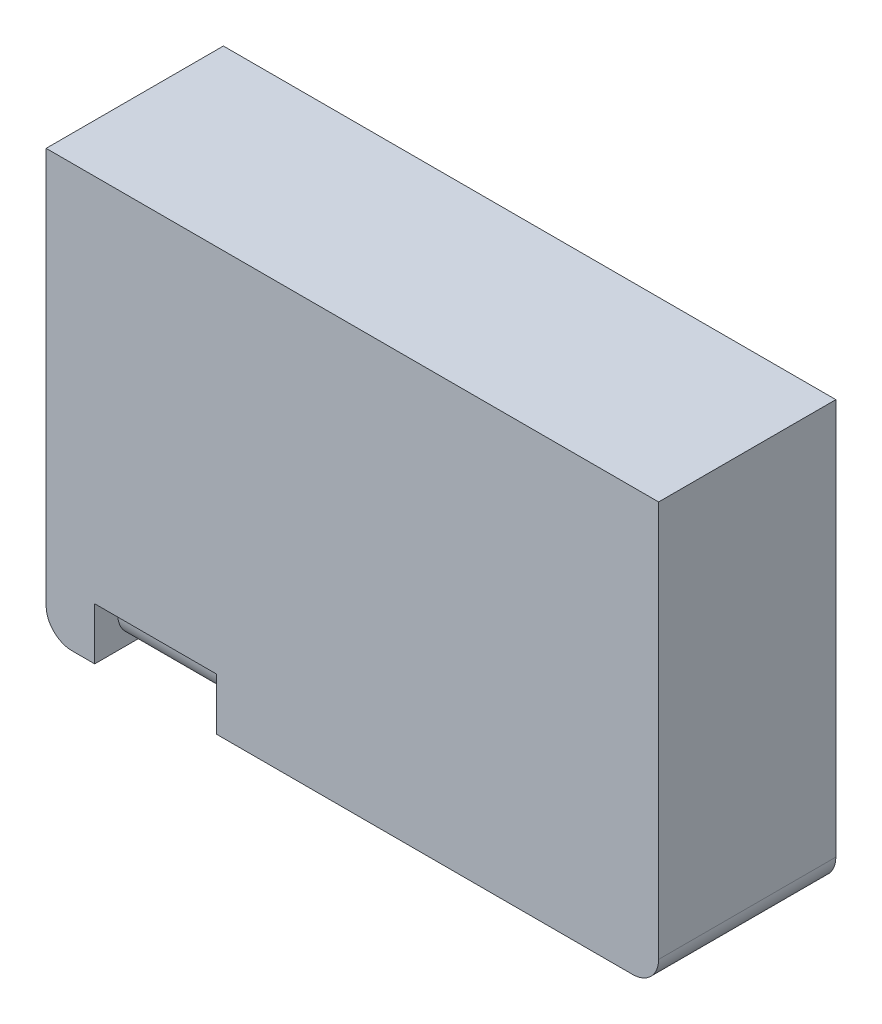
ISO-10303-21;
HEADER;
FILE_DESCRIPTION(('STEP AP214'),'2;1');
FILE_NAME('part.step','',(''),(''),'','','');
FILE_SCHEMA(('AUTOMOTIVE_DESIGN { 1 0 10303 214 1 1 1 1 }'));
ENDSEC;
DATA;
#1=APPLICATION_CONTEXT('core data for automotive mechanical design processes');
#2=APPLICATION_PROTOCOL_DEFINITION('international standard','automotive_design',2000,#1);
#3=PRODUCT_CONTEXT('',#1,'mechanical');
#4=PRODUCT('Part','Part','',(#3));
#5=PRODUCT_RELATED_PRODUCT_CATEGORY('part','',(#4));
#6=PRODUCT_DEFINITION_FORMATION('','',#4);
#7=PRODUCT_DEFINITION_CONTEXT('part definition',#1,'design');
#8=PRODUCT_DEFINITION('design','',#6,#7);
#9=PRODUCT_DEFINITION_SHAPE('','',#8);
#10=(LENGTH_UNIT() NAMED_UNIT(*) SI_UNIT(.MILLI.,.METRE.));
#11=(NAMED_UNIT(*) PLANE_ANGLE_UNIT() SI_UNIT($,.RADIAN.));
#12=(NAMED_UNIT(*) SI_UNIT($,.STERADIAN.) SOLID_ANGLE_UNIT());
#13=UNCERTAINTY_MEASURE_WITH_UNIT(LENGTH_MEASURE(1.E-05),#10,'distance_accuracy_value','');
#14=(GEOMETRIC_REPRESENTATION_CONTEXT(3) GLOBAL_UNCERTAINTY_ASSIGNED_CONTEXT((#13)) GLOBAL_UNIT_ASSIGNED_CONTEXT((#10,
#11,#12)) REPRESENTATION_CONTEXT('',''));
#15=CARTESIAN_POINT('',(0.,0.,0.));
#16=DIRECTION('',(0.,0.,1.));
#17=DIRECTION('',(1.,0.,0.));
#18=AXIS2_PLACEMENT_3D('',#15,#16,#17);
#19=CARTESIAN_POINT('',(-15.98855676772,8.40136893988951,3.51594109723408));
#20=DIRECTION('',(0.,-1.,0.));
#21=DIRECTION('',(0.,0.,-1.));
#22=AXIS2_PLACEMENT_3D('',#19,#20,#21);
#23=PLANE('',#22);
#24=CARTESIAN_POINT('',(-15.98855676772,8.40136893988951,3.51594109723408));
#25=DIRECTION('',(0.,-1.,0.));
#26=DIRECTION('',(0.,0.,-1.));
#27=AXIS2_PLACEMENT_3D('',#24,#25,#26);
#28=CIRCLE('',#27,2.23657179383415);
#29=CARTESIAN_POINT('',(-15.98855676772,8.40136893988951,1.27936930339993));
#30=VERTEX_POINT('',#29);
#31=EDGE_CURVE('E307',#30,#30,#28,.T.);
#32=ORIENTED_EDGE('',*,*,#31,.T.);
#33=EDGE_LOOP('',(#32));
#34=FACE_BOUND('',#33,.T.);
#35=CARTESIAN_POINT('',(-16.0072939575495,8.40136893988951,3.49456509505508));
#36=DIRECTION('',(0.,-1.,0.));
#37=DIRECTION('',(0.,0.,-1.));
#38=AXIS2_PLACEMENT_3D('',#35,#36,#37);
#39=CIRCLE('',#38,2.01406143035815);
#40=CARTESIAN_POINT('',(-16.0072939575495,8.40136893988951,1.48050366469693));
#41=VERTEX_POINT('',#40);
#42=EDGE_CURVE('E731',#41,#41,#39,.T.);
#43=ORIENTED_EDGE('',*,*,#42,.F.);
#44=EDGE_LOOP('',(#43));
#45=FACE_BOUND('',#44,.T.);
#46=ADVANCED_FACE('F32',(#34,#45),#23,.T.);
#47=CARTESIAN_POINT('',(-11.1839949356032,8.40136893988951,5.85252200811822));
#48=DIRECTION('',(-1.,0.,0.));
#49=DIRECTION('',(0.,0.,1.));
#50=AXIS2_PLACEMENT_3D('',#47,#48,#49);
#51=PLANE('',#50);
#52=DIRECTION('',(0.,0.,-1.));
#53=VECTOR('',#52,1.);
#54=CARTESIAN_POINT('',(-11.1839949356032,8.40136893988951,5.85252200811822));
#55=LINE('',#54,#53);
#56=CARTESIAN_POINT('',(-11.1839949356032,8.40136893988951,1.60240741387518));
#57=VERTEX_POINT('',#56);
#58=CARTESIAN_POINT('',(-11.1839949356032,8.40136893988951,1.37937842044992));
#59=VERTEX_POINT('',#58);
#60=EDGE_CURVE('E197',#57,#59,#55,.T.);
#61=ORIENTED_EDGE('',*,*,#60,.F.);
#62=CARTESIAN_POINT('',(-11.1839949356032,8.60136893988951,3.59238228808842));
#63=DIRECTION('',(-1.,0.,0.));
#64=DIRECTION('',(0.,0.,1.));
#65=AXIS2_PLACEMENT_3D('',#62,#63,#64);
#66=CIRCLE('',#65,2.);
#67=CARTESIAN_POINT('',(-11.1839949356032,6.60136893988951,3.59238228808842));
#68=VERTEX_POINT('',#67);
#69=EDGE_CURVE('E11',#57,#68,#66,.T.);
#70=ORIENTED_EDGE('',*,*,#69,.T.);
#71=DIRECTION('',(0.,0.,-1.));
#72=VECTOR('',#71,1.);
#73=CARTESIAN_POINT('',(-11.1839949356032,6.60136893988951,5.68732521616511));
#74=LINE('',#73,#72);
#75=CARTESIAN_POINT('',(-11.1839949356032,6.60136893988951,3.69735034195187));
#76=VERTEX_POINT('',#75);
#77=EDGE_CURVE('E232',#76,#68,#74,.T.);
#78=ORIENTED_EDGE('',*,*,#77,.F.);
#79=CARTESIAN_POINT('',(-11.1839949356032,8.60136893988951,3.69735034195187));
#80=DIRECTION('',(-1.,0.,0.));
#81=DIRECTION('',(0.,0.,1.));
#82=AXIS2_PLACEMENT_3D('',#79,#80,#81);
#83=CIRCLE('',#82,2.);
#84=CARTESIAN_POINT('',(-11.1839949356032,8.40136893988951,5.68732521616511));
#85=VERTEX_POINT('',#84);
#86=EDGE_CURVE('E221',#76,#85,#83,.T.);
#87=ORIENTED_EDGE('',*,*,#86,.T.);
#88=CARTESIAN_POINT('',(-11.1839949356032,8.40136893988951,5.85252200811822));
#89=VERTEX_POINT('',#88);
#90=EDGE_CURVE('E212',#89,#85,#55,.T.);
#91=ORIENTED_EDGE('',*,*,#90,.F.);
#92=DIRECTION('',(0.,-1.,0.));
#93=VECTOR('',#92,1.);
#94=CARTESIAN_POINT('',(-11.1839949356032,8.40136893988951,5.85252200811822));
#95=LINE('',#94,#93);
#96=CARTESIAN_POINT('',(-11.1839949356032,6.40136893988951,5.85252200811822));
#97=VERTEX_POINT('',#96);
#98=EDGE_CURVE('E299',#89,#97,#95,.T.);
#99=ORIENTED_EDGE('',*,*,#98,.T.);
#100=DIRECTION('',(0.,0.,-1.));
#101=VECTOR('',#100,1.);
#102=CARTESIAN_POINT('',(-11.1839949356032,6.40136893988951,5.85252200811822));
#103=LINE('',#102,#101);
#104=CARTESIAN_POINT('',(-11.1839949356032,6.40136893988951,1.37937842044992));
#105=VERTEX_POINT('',#104);
#106=EDGE_CURVE('E279',#97,#105,#103,.T.);
#107=ORIENTED_EDGE('',*,*,#106,.T.);
#108=DIRECTION('',(0.,-1.,0.));
#109=VECTOR('',#108,1.);
#110=CARTESIAN_POINT('',(-11.1839949356032,8.40136893988951,1.37937842044992));
#111=LINE('',#110,#109);
#112=EDGE_CURVE('E210',#59,#105,#111,.T.);
#113=ORIENTED_EDGE('',*,*,#112,.F.);
#114=EDGE_LOOP('',(#61,#70,#78,#87,#91,#99,#107,#113));
#115=FACE_BOUND('',#114,.T.);
#116=ADVANCED_FACE('F206',(#115),#51,.F.);
#117=CARTESIAN_POINT('',(-4.61842795697809,8.40136893988951,5.85252200811822));
#118=DIRECTION('',(1.,0.,0.));
#119=DIRECTION('',(0.,0.,-1.));
#120=AXIS2_PLACEMENT_3D('',#117,#118,#119);
#121=PLANE('',#120);
#122=DIRECTION('',(0.,0.,1.));
#123=VECTOR('',#122,1.);
#124=CARTESIAN_POINT('',(-4.61842795697809,6.60136893988951,5.68732521616511));
#125=LINE('',#124,#123);
#126=CARTESIAN_POINT('',(-4.61842795697809,6.60136893988951,3.59238228808842));
#127=VERTEX_POINT('',#126);
#128=CARTESIAN_POINT('',(-4.61842795697809,6.60136893988951,3.69735034195187));
#129=VERTEX_POINT('',#128);
#130=EDGE_CURVE('E229',#127,#129,#125,.T.);
#131=ORIENTED_EDGE('',*,*,#130,.F.);
#132=CARTESIAN_POINT('',(-4.61842795697809,8.60136893988951,3.59238228808842));
#133=DIRECTION('',(1.,0.,0.));
#134=DIRECTION('',(0.,0.,-1.));
#135=AXIS2_PLACEMENT_3D('',#132,#133,#134);
#136=CIRCLE('',#135,2.);
#137=CARTESIAN_POINT('',(-4.61842795697809,8.40136893988951,1.60240741387518));
#138=VERTEX_POINT('',#137);
#139=EDGE_CURVE('E40',#127,#138,#136,.T.);
#140=ORIENTED_EDGE('',*,*,#139,.T.);
#141=DIRECTION('',(0.,0.,1.));
#142=VECTOR('',#141,1.);
#143=CARTESIAN_POINT('',(-4.61842795697809,8.40136893988951,5.85252200811822));
#144=LINE('',#143,#142);
#145=CARTESIAN_POINT('',(-4.61842795697809,8.40136893988951,1.37937842044992));
#146=VERTEX_POINT('',#145);
#147=EDGE_CURVE('E200',#146,#138,#144,.T.);
#148=ORIENTED_EDGE('',*,*,#147,.F.);
#149=DIRECTION('',(0.,-1.,0.));
#150=VECTOR('',#149,1.);
#151=CARTESIAN_POINT('',(-4.61842795697809,8.40136893988951,1.37937842044992));
#152=LINE('',#151,#150);
#153=CARTESIAN_POINT('',(-4.61842795697809,6.40136893988951,1.37937842044992));
#154=VERTEX_POINT('',#153);
#155=EDGE_CURVE('E304',#146,#154,#152,.T.);
#156=ORIENTED_EDGE('',*,*,#155,.T.);
#157=DIRECTION('',(0.,0.,1.));
#158=VECTOR('',#157,1.);
#159=CARTESIAN_POINT('',(-4.61842795697809,6.40136893988951,5.85252200811822));
#160=LINE('',#159,#158);
#161=CARTESIAN_POINT('',(-4.61842795697809,6.40136893988951,5.85252200811822));
#162=VERTEX_POINT('',#161);
#163=EDGE_CURVE('E294',#154,#162,#160,.T.);
#164=ORIENTED_EDGE('',*,*,#163,.T.);
#165=DIRECTION('',(0.,-1.,0.));
#166=VECTOR('',#165,1.);
#167=CARTESIAN_POINT('',(-4.61842795697809,8.40136893988951,5.85252200811822));
#168=LINE('',#167,#166);
#169=CARTESIAN_POINT('',(-4.61842795697809,8.40136893988951,5.85252200811822));
#170=VERTEX_POINT('',#169);
#171=EDGE_CURVE('E302',#170,#162,#168,.T.);
#172=ORIENTED_EDGE('',*,*,#171,.F.);
#173=CARTESIAN_POINT('',(-4.61842795697809,8.40136893988951,5.68732521616511));
#174=VERTEX_POINT('',#173);
#175=EDGE_CURVE('E285',#174,#170,#144,.T.);
#176=ORIENTED_EDGE('',*,*,#175,.F.);
#177=CARTESIAN_POINT('',(-4.61842795697809,8.60136893988951,3.69735034195187));
#178=DIRECTION('',(1.,0.,0.));
#179=DIRECTION('',(0.,0.,-1.));
#180=AXIS2_PLACEMENT_3D('',#177,#178,#179);
#181=CIRCLE('',#180,2.);
#182=EDGE_CURVE('E47',#174,#129,#181,.T.);
#183=ORIENTED_EDGE('',*,*,#182,.T.);
#184=EDGE_LOOP('',(#131,#140,#148,#156,#164,#172,#176,#183));
#185=FACE_BOUND('',#184,.T.);
#186=ADVANCED_FACE('F228',(#185),#121,.F.);
#187=CARTESIAN_POINT('',(0.,8.40136893988951,0.));
#188=DIRECTION('',(0.,-1.,0.));
#189=DIRECTION('',(0.,0.,-1.));
#190=AXIS2_PLACEMENT_3D('',#187,#188,#189);
#191=PLANE('',#190);
#192=ORIENTED_EDGE('',*,*,#147,.T.);
#193=DIRECTION('',(1.,0.,0.));
#194=VECTOR('',#193,1.);
#195=CARTESIAN_POINT('',(-11.1839949356032,8.40136893988951,1.60240741387518));
#196=LINE('',#195,#194);
#197=EDGE_CURVE('E193',#57,#138,#196,.T.);
#198=ORIENTED_EDGE('',*,*,#197,.F.);
#199=ORIENTED_EDGE('',*,*,#60,.T.);
#200=DIRECTION('',(1.,0.,0.));
#201=VECTOR('',#200,1.);
#202=CARTESIAN_POINT('',(-11.1839949356032,8.40136893988951,1.37937842044992));
#203=LINE('',#202,#201);
#204=EDGE_CURVE('E283',#59,#146,#203,.T.);
#205=ORIENTED_EDGE('',*,*,#204,.T.);
#206=EDGE_LOOP('',(#192,#198,#199,#205));
#207=FACE_BOUND('',#206,.T.);
#208=ADVANCED_FACE('F195',(#207),#191,.T.);
#209=ORIENTED_EDGE('',*,*,#90,.T.);
#210=DIRECTION('',(-1.,0.,0.));
#211=VECTOR('',#210,1.);
#212=CARTESIAN_POINT('',(-11.1839949356032,8.40136893988951,5.68732521616511));
#213=LINE('',#212,#211);
#214=EDGE_CURVE('E202',#174,#85,#213,.T.);
#215=ORIENTED_EDGE('',*,*,#214,.F.);
#216=ORIENTED_EDGE('',*,*,#175,.T.);
#217=DIRECTION('',(-1.,0.,0.));
#218=VECTOR('',#217,1.);
#219=CARTESIAN_POINT('',(-11.1839949356032,8.40136893988951,5.85252200811822));
#220=LINE('',#219,#218);
#221=EDGE_CURVE('E287',#170,#89,#220,.T.);
#222=ORIENTED_EDGE('',*,*,#221,.T.);
#223=EDGE_LOOP('',(#209,#215,#216,#222));
#224=FACE_BOUND('',#223,.T.);
#225=ADVANCED_FACE('F651',(#224),#191,.T.);
#226=CARTESIAN_POINT('',(-20.2221143382022,8.40136893988951,7.39617531899279));
#227=DIRECTION('',(1.,0.,0.));
#228=DIRECTION('',(0.,0.,-1.));
#229=AXIS2_PLACEMENT_3D('',#226,#227,#228);
#230=PLANE('',#229);
#231=DIRECTION('',(0.,1.,0.));
#232=VECTOR('',#231,1.);
#233=CARTESIAN_POINT('',(-20.2221143382022,6.60136893988951,5.91717845167139));
#234=LINE('',#233,#232);
#235=CARTESIAN_POINT('',(-20.2221143382022,7.60136893988951,5.91717845167139));
#236=VERTEX_POINT('',#235);
#237=CARTESIAN_POINT('',(-20.2221143382022,8.40136893988951,5.91717845167139));
#238=VERTEX_POINT('',#237);
#239=EDGE_CURVE('E256',#236,#238,#234,.T.);
#240=ORIENTED_EDGE('',*,*,#239,.F.);
#241=CARTESIAN_POINT('',(-20.2221143382022,7.60136893988951,4.91717845167139));
#242=DIRECTION('',(1.,0.,0.));
#243=DIRECTION('',(0.,0.,-1.));
#244=AXIS2_PLACEMENT_3D('',#241,#242,#243);
#245=CIRCLE('',#244,1.);
#246=CARTESIAN_POINT('',(-20.2221143382022,6.60136893988951,4.91717845167139));
#247=VERTEX_POINT('',#246);
#248=EDGE_CURVE('E218',#236,#247,#245,.T.);
#249=ORIENTED_EDGE('',*,*,#248,.T.);
#250=DIRECTION('',(0.,0.,1.));
#251=VECTOR('',#250,1.);
#252=CARTESIAN_POINT('',(-20.2221143382022,6.60136893988951,5.91717845167139));
#253=LINE('',#252,#251);
#254=CARTESIAN_POINT('',(-20.2221143382022,6.60136893988951,2.67528692561891));
#255=VERTEX_POINT('',#254);
#256=EDGE_CURVE('E242',#255,#247,#253,.T.);
#257=ORIENTED_EDGE('',*,*,#256,.F.);
#258=CARTESIAN_POINT('',(-20.2221143382022,7.60136893988951,2.67528692561891));
#259=DIRECTION('',(1.,0.,0.));
#260=DIRECTION('',(0.,0.,-1.));
#261=AXIS2_PLACEMENT_3D('',#258,#259,#260);
#262=CIRCLE('',#261,1.);
#263=CARTESIAN_POINT('',(-20.2221143382022,7.60136893988951,1.67528692561891));
#264=VERTEX_POINT('',#263);
#265=EDGE_CURVE('E375',#255,#264,#262,.T.);
#266=ORIENTED_EDGE('',*,*,#265,.T.);
#267=DIRECTION('',(0.,1.,0.));
#268=VECTOR('',#267,1.);
#269=CARTESIAN_POINT('',(-20.2221143382022,6.60136893988951,1.67528692561891));
#270=LINE('',#269,#268);
#271=CARTESIAN_POINT('',(-20.2221143382022,8.40136893988951,1.67528692561891));
#272=VERTEX_POINT('',#271);
#273=EDGE_CURVE('E247',#264,#272,#270,.T.);
#274=ORIENTED_EDGE('',*,*,#273,.T.);
#275=DIRECTION('',(0.,0.,1.));
#276=VECTOR('',#275,1.);
#277=CARTESIAN_POINT('',(-20.2221143382022,8.40136893988951,7.39617531899279));
#278=LINE('',#277,#276);
#279=CARTESIAN_POINT('',(-20.2221143382022,8.40136893988951,1.32689569169742));
#280=VERTEX_POINT('',#279);
#281=EDGE_CURVE('E259',#280,#272,#278,.T.);
#282=ORIENTED_EDGE('',*,*,#281,.F.);
#283=DIRECTION('',(0.,-1.,0.));
#284=VECTOR('',#283,1.);
#285=CARTESIAN_POINT('',(-20.2221143382022,8.40136893988951,1.32689569169742));
#286=LINE('',#285,#284);
#287=CARTESIAN_POINT('',(-20.2221143382022,6.40136893988951,1.32689569169742));
#288=VERTEX_POINT('',#287);
#289=EDGE_CURVE('E277',#280,#288,#286,.T.);
#290=ORIENTED_EDGE('',*,*,#289,.T.);
#291=DIRECTION('',(0.,0.,1.));
#292=VECTOR('',#291,1.);
#293=CARTESIAN_POINT('',(-20.2221143382022,6.40136893988951,7.39617531899279));
#294=LINE('',#293,#292);
#295=CARTESIAN_POINT('',(-20.2221143382022,6.40136893988951,6.8));
#296=VERTEX_POINT('',#295);
#297=EDGE_CURVE('E258',#288,#296,#294,.T.);
#298=ORIENTED_EDGE('',*,*,#297,.T.);
#299=DIRECTION('',(0.,1.,0.));
#300=VECTOR('',#299,1.);
#301=CARTESIAN_POINT('',(-20.2221143382022,0.,6.8));
#302=LINE('',#301,#300);
#303=CARTESIAN_POINT('',(-20.2221143382022,8.40136893988951,6.8));
#304=VERTEX_POINT('',#303);
#305=EDGE_CURVE('E362',#296,#304,#302,.T.);
#306=ORIENTED_EDGE('',*,*,#305,.T.);
#307=EDGE_CURVE('E263',#238,#304,#278,.T.);
#308=ORIENTED_EDGE('',*,*,#307,.F.);
#309=EDGE_LOOP('',(#240,#249,#257,#266,#274,#282,#290,#298,#306,#308));
#310=FACE_BOUND('',#309,.T.);
#311=ADVANCED_FACE('F394',(#310),#230,.F.);
#312=CARTESIAN_POINT('',(-24.8934856466105,8.40136893988951,7.39617531899279));
#313=DIRECTION('',(-1.,0.,0.));
#314=DIRECTION('',(0.,0.,1.));
#315=AXIS2_PLACEMENT_3D('',#312,#313,#314);
#316=PLANE('',#315);
#317=DIRECTION('',(0.,0.,-1.));
#318=VECTOR('',#317,1.);
#319=CARTESIAN_POINT('',(-24.8934856466105,6.60136893988951,5.91717845167139));
#320=LINE('',#319,#318);
#321=CARTESIAN_POINT('',(-24.8934856466105,6.60136893988951,4.91717845167139));
#322=VERTEX_POINT('',#321);
#323=CARTESIAN_POINT('',(-24.8934856466105,6.60136893988951,2.67528692561891));
#324=VERTEX_POINT('',#323);
#325=EDGE_CURVE('E245',#322,#324,#320,.T.);
#326=ORIENTED_EDGE('',*,*,#325,.F.);
#327=CARTESIAN_POINT('',(-24.8934856466105,7.60136893988951,4.91717845167139));
#328=DIRECTION('',(-1.,0.,0.));
#329=DIRECTION('',(0.,0.,1.));
#330=AXIS2_PLACEMENT_3D('',#327,#328,#329);
#331=CIRCLE('',#330,1.);
#332=CARTESIAN_POINT('',(-24.8934856466105,7.60136893988951,5.91717845167139));
#333=VERTEX_POINT('',#332);
#334=EDGE_CURVE('E223',#322,#333,#331,.T.);
#335=ORIENTED_EDGE('',*,*,#334,.T.);
#336=DIRECTION('',(0.,1.,0.));
#337=VECTOR('',#336,1.);
#338=CARTESIAN_POINT('',(-24.8934856466105,6.60136893988951,5.91717845167139));
#339=LINE('',#338,#337);
#340=CARTESIAN_POINT('',(-24.8934856466105,8.40136893988951,5.91717845167139));
#341=VERTEX_POINT('',#340);
#342=EDGE_CURVE('E254',#333,#341,#339,.T.);
#343=ORIENTED_EDGE('',*,*,#342,.T.);
#344=DIRECTION('',(0.,0.,-1.));
#345=VECTOR('',#344,1.);
#346=CARTESIAN_POINT('',(-24.8934856466105,8.40136893988951,7.39617531899279));
#347=LINE('',#346,#345);
#348=CARTESIAN_POINT('',(-24.8934856466105,8.40136893988951,6.8));
#349=VERTEX_POINT('',#348);
#350=EDGE_CURVE('E264',#349,#341,#347,.T.);
#351=ORIENTED_EDGE('',*,*,#350,.F.);
#352=DIRECTION('',(0.,-1.,0.));
#353=VECTOR('',#352,1.);
#354=CARTESIAN_POINT('',(-24.8934856466105,0.,6.8));
#355=LINE('',#354,#353);
#356=CARTESIAN_POINT('',(-24.8934856466105,6.40136893988951,6.8));
#357=VERTEX_POINT('',#356);
#358=EDGE_CURVE('E360',#349,#357,#355,.T.);
#359=ORIENTED_EDGE('',*,*,#358,.T.);
#360=DIRECTION('',(0.,0.,-1.));
#361=VECTOR('',#360,1.);
#362=CARTESIAN_POINT('',(-24.8934856466105,6.40136893988951,7.39617531899279));
#363=LINE('',#362,#361);
#364=CARTESIAN_POINT('',(-24.8934856466105,6.40136893988951,1.32689569169742));
#365=VERTEX_POINT('',#364);
#366=EDGE_CURVE('E272',#357,#365,#363,.T.);
#367=ORIENTED_EDGE('',*,*,#366,.T.);
#368=DIRECTION('',(0.,-1.,0.));
#369=VECTOR('',#368,1.);
#370=CARTESIAN_POINT('',(-24.8934856466105,8.40136893988951,1.32689569169742));
#371=LINE('',#370,#369);
#372=CARTESIAN_POINT('',(-24.8934856466105,8.40136893988951,1.32689569169742));
#373=VERTEX_POINT('',#372);
#374=EDGE_CURVE('E270',#373,#365,#371,.T.);
#375=ORIENTED_EDGE('',*,*,#374,.F.);
#376=CARTESIAN_POINT('',(-24.8934856466105,8.40136893988951,1.67528692561891));
#377=VERTEX_POINT('',#376);
#378=EDGE_CURVE('E262',#377,#373,#347,.T.);
#379=ORIENTED_EDGE('',*,*,#378,.F.);
#380=DIRECTION('',(0.,1.,0.));
#381=VECTOR('',#380,1.);
#382=CARTESIAN_POINT('',(-24.8934856466105,6.60136893988951,1.67528692561891));
#383=LINE('',#382,#381);
#384=CARTESIAN_POINT('',(-24.8934856466105,7.60136893988951,1.67528692561891));
#385=VERTEX_POINT('',#384);
#386=EDGE_CURVE('E252',#385,#377,#383,.T.);
#387=ORIENTED_EDGE('',*,*,#386,.F.);
#388=CARTESIAN_POINT('',(-24.8934856466105,7.60136893988951,2.67528692561891));
#389=DIRECTION('',(-1.,0.,0.));
#390=DIRECTION('',(0.,0.,1.));
#391=AXIS2_PLACEMENT_3D('',#388,#389,#390);
#392=CIRCLE('',#391,1.);
#393=EDGE_CURVE('E377',#385,#324,#392,.T.);
#394=ORIENTED_EDGE('',*,*,#393,.T.);
#395=EDGE_LOOP('',(#326,#335,#343,#351,#359,#367,#375,#379,#387,#394));
#396=FACE_BOUND('',#395,.T.);
#397=ADVANCED_FACE('F381',(#396),#316,.F.);
#398=CARTESIAN_POINT('',(0.,8.40136893988951,0.));
#399=DIRECTION('',(0.,1.,0.));
#400=DIRECTION('',(0.,0.,1.));
#401=AXIS2_PLACEMENT_3D('',#398,#399,#400);
#402=PLANE('',#401);
#403=DIRECTION('',(-1.,0.,0.));
#404=VECTOR('',#403,1.);
#405=CARTESIAN_POINT('',(-20.2221143382022,8.40136893988951,5.91717845167139));
#406=LINE('',#405,#404);
#407=EDGE_CURVE('E231',#238,#341,#406,.T.);
#408=ORIENTED_EDGE('',*,*,#407,.F.);
#409=ORIENTED_EDGE('',*,*,#307,.T.);
#410=DIRECTION('',(-1.,0.,0.));
#411=VECTOR('',#410,1.);
#412=CARTESIAN_POINT('',(0.,8.40136893988951,6.8));
#413=LINE('',#412,#411);
#414=EDGE_CURVE('E358',#304,#349,#413,.T.);
#415=ORIENTED_EDGE('',*,*,#414,.T.);
#416=ORIENTED_EDGE('',*,*,#350,.T.);
#417=EDGE_LOOP('',(#408,#409,#415,#416));
#418=FACE_BOUND('',#417,.T.);
#419=ADVANCED_FACE('F463',(#418),#402,.F.);
#420=DIRECTION('',(1.,0.,0.));
#421=VECTOR('',#420,1.);
#422=CARTESIAN_POINT('',(-20.2221143382022,8.40136893988951,1.67528692561891));
#423=LINE('',#422,#421);
#424=EDGE_CURVE('E235',#377,#272,#423,.T.);
#425=ORIENTED_EDGE('',*,*,#424,.F.);
#426=ORIENTED_EDGE('',*,*,#378,.T.);
#427=DIRECTION('',(1.,0.,0.));
#428=VECTOR('',#427,1.);
#429=CARTESIAN_POINT('',(-20.2221143382022,8.40136893988951,1.32689569169742));
#430=LINE('',#429,#428);
#431=EDGE_CURVE('E267',#373,#280,#430,.T.);
#432=ORIENTED_EDGE('',*,*,#431,.T.);
#433=ORIENTED_EDGE('',*,*,#281,.T.);
#434=EDGE_LOOP('',(#425,#426,#432,#433));
#435=FACE_BOUND('',#434,.T.);
#436=ADVANCED_FACE('F411',(#435),#402,.F.);
#437=CARTESIAN_POINT('',(-26.7570543923098,22.6013689398895,6.8));
#438=DIRECTION('',(1.,0.,0.));
#439=DIRECTION('',(0.,1.,0.));
#440=AXIS2_PLACEMENT_3D('',#437,#438,#439);
#441=PLANE('',#440);
#442=DIRECTION('',(0.,-1.,0.));
#443=VECTOR('',#442,1.);
#444=CARTESIAN_POINT('',(-26.7570543923098,22.6013689398895,0.));
#445=LINE('',#444,#443);
#446=CARTESIAN_POINT('',(-26.7570543923098,22.6013689398895,0.));
#447=VERTEX_POINT('',#446);
#448=CARTESIAN_POINT('',(-26.7570543923098,7.4013689398895,0.));
#449=VERTEX_POINT('',#448);
#450=EDGE_CURVE('E310',#447,#449,#445,.T.);
#451=ORIENTED_EDGE('',*,*,#450,.T.);
#452=DIRECTION('',(0.,0.,-1.));
#453=VECTOR('',#452,1.);
#454=CARTESIAN_POINT('',(-26.7570543923098,7.4013689398895,6.8));
#455=LINE('',#454,#453);
#456=CARTESIAN_POINT('',(-26.7570543923098,7.4013689398895,6.8));
#457=VERTEX_POINT('',#456);
#458=EDGE_CURVE('E356',#449,#457,#455,.F.);
#459=ORIENTED_EDGE('',*,*,#458,.T.);
#460=DIRECTION('',(0.,-1.,0.));
#461=VECTOR('',#460,1.);
#462=CARTESIAN_POINT('',(-26.7570543923098,22.6013689398895,6.8));
#463=LINE('',#462,#461);
#464=CARTESIAN_POINT('',(-26.7570543923098,22.6013689398895,6.8));
#465=VERTEX_POINT('',#464);
#466=EDGE_CURVE('E313',#465,#457,#463,.T.);
#467=ORIENTED_EDGE('',*,*,#466,.F.);
#468=DIRECTION('',(0.,0.,-1.));
#469=VECTOR('',#468,1.);
#470=CARTESIAN_POINT('',(-26.7570543923098,22.6013689398895,6.8));
#471=LINE('',#470,#469);
#472=EDGE_CURVE('E325',#465,#447,#471,.T.);
#473=ORIENTED_EDGE('',*,*,#472,.T.);
#474=EDGE_LOOP('',(#451,#459,#467,#473));
#475=FACE_BOUND('',#474,.T.);
#476=ADVANCED_FACE('F454',(#475),#441,.F.);
#477=CARTESIAN_POINT('',(-26.7570543923098,6.40136893988951,6.8));
#478=DIRECTION('',(0.,1.,0.));
#479=DIRECTION('',(0.,0.,1.));
#480=AXIS2_PLACEMENT_3D('',#477,#478,#479);
#481=PLANE('',#480);
#482=DIRECTION('',(1.,0.,0.));
#483=VECTOR('',#482,1.);
#484=CARTESIAN_POINT('',(-11.1839949356032,6.40136893988951,1.37937842044992));
#485=LINE('',#484,#483);
#486=EDGE_CURVE('E291',#105,#154,#485,.T.);
#487=ORIENTED_EDGE('',*,*,#486,.F.);
#488=ORIENTED_EDGE('',*,*,#106,.F.);
#489=DIRECTION('',(-1.,0.,0.));
#490=VECTOR('',#489,1.);
#491=CARTESIAN_POINT('',(-11.1839949356032,6.40136893988951,5.85252200811822));
#492=LINE('',#491,#490);
#493=EDGE_CURVE('E213',#162,#97,#492,.T.);
#494=ORIENTED_EDGE('',*,*,#493,.F.);
#495=ORIENTED_EDGE('',*,*,#163,.F.);
#496=EDGE_LOOP('',(#487,#488,#494,#495));
#497=FACE_BOUND('',#496,.T.);
#498=CARTESIAN_POINT('',(-15.98855676772,6.40136893988951,3.51594109723408));
#499=DIRECTION('',(0.,-1.,0.));
#500=DIRECTION('',(0.,0.,-1.));
#501=AXIS2_PLACEMENT_3D('',#498,#499,#500);
#502=CIRCLE('',#501,2.23657179383415);
#503=CARTESIAN_POINT('',(-15.98855676772,6.40136893988951,1.27936930339993));
#504=VERTEX_POINT('',#503);
#505=EDGE_CURVE('E301',#504,#504,#502,.T.);
#506=ORIENTED_EDGE('',*,*,#505,.F.);
#507=EDGE_LOOP('',(#506));
#508=FACE_BOUND('',#507,.T.);
#509=DIRECTION('',(1.,0.,0.));
#510=VECTOR('',#509,1.);
#511=CARTESIAN_POINT('',(-26.7570543923098,6.40136893988951,6.8));
#512=LINE('',#511,#510);
#513=CARTESIAN_POINT('',(-4.25705439230976,6.40136893988951,6.8));
#514=VERTEX_POINT('',#513);
#515=EDGE_CURVE('E316',#296,#514,#512,.T.);
#516=ORIENTED_EDGE('',*,*,#515,.F.);
#517=ORIENTED_EDGE('',*,*,#297,.F.);
#518=DIRECTION('',(1.,0.,0.));
#519=VECTOR('',#518,1.);
#520=CARTESIAN_POINT('',(-20.2221143382022,6.40136893988951,1.32689569169742));
#521=LINE('',#520,#519);
#522=EDGE_CURVE('E274',#365,#288,#521,.T.);
#523=ORIENTED_EDGE('',*,*,#522,.F.);
#524=ORIENTED_EDGE('',*,*,#366,.F.);
#525=CARTESIAN_POINT('',(-25.7570543923098,6.40136893988951,6.8));
#526=VERTEX_POINT('',#525);
#527=EDGE_CURVE('E318',#526,#357,#512,.T.);
#528=ORIENTED_EDGE('',*,*,#527,.F.);
#529=DIRECTION('',(0.,0.,-1.));
#530=VECTOR('',#529,1.);
#531=CARTESIAN_POINT('',(-25.7570543923098,6.40136893988951,6.8));
#532=LINE('',#531,#530);
#533=CARTESIAN_POINT('',(-25.7570543923098,6.40136893988951,0.));
#534=VERTEX_POINT('',#533);
#535=EDGE_CURVE('E346',#526,#534,#532,.T.);
#536=ORIENTED_EDGE('',*,*,#535,.T.);
#537=DIRECTION('',(1.,0.,0.));
#538=VECTOR('',#537,1.);
#539=CARTESIAN_POINT('',(-26.7570543923098,6.40136893988951,0.));
#540=LINE('',#539,#538);
#541=CARTESIAN_POINT('',(-4.25705439230976,6.40136893988951,0.));
#542=VERTEX_POINT('',#541);
#543=EDGE_CURVE('E328',#534,#542,#540,.T.);
#544=ORIENTED_EDGE('',*,*,#543,.T.);
#545=DIRECTION('',(0.,0.,-1.));
#546=VECTOR('',#545,1.);
#547=CARTESIAN_POINT('',(-4.25705439230976,6.40136893988951,6.8));
#548=LINE('',#547,#546);
#549=EDGE_CURVE('E349',#542,#514,#548,.F.);
#550=ORIENTED_EDGE('',*,*,#549,.T.);
#551=EDGE_LOOP('',(#516,#517,#523,#524,#528,#536,#544,#550));
#552=FACE_BOUND('',#551,.T.);
#553=ADVANCED_FACE('F426',(#497,#508,#552),#481,.F.);
#554=CARTESIAN_POINT('',(-3.25705439230977,22.6013689398895,6.8));
#555=DIRECTION('',(-1.,0.,0.));
#556=DIRECTION('',(0.,-1.,0.));
#557=AXIS2_PLACEMENT_3D('',#554,#555,#556);
#558=PLANE('',#557);
#559=DIRECTION('',(0.,1.,0.));
#560=VECTOR('',#559,1.);
#561=CARTESIAN_POINT('',(-3.25705439230977,22.6013689398895,6.8));
#562=LINE('',#561,#560);
#563=CARTESIAN_POINT('',(-3.25705439230976,7.4013689398895,6.8));
#564=VERTEX_POINT('',#563);
#565=CARTESIAN_POINT('',(-3.25705439230977,22.6013689398895,6.8));
#566=VERTEX_POINT('',#565);
#567=EDGE_CURVE('E321',#564,#566,#562,.T.);
#568=ORIENTED_EDGE('',*,*,#567,.F.);
#569=DIRECTION('',(0.,0.,-1.));
#570=VECTOR('',#569,1.);
#571=CARTESIAN_POINT('',(-3.25705439230976,7.4013689398895,6.8));
#572=LINE('',#571,#570);
#573=CARTESIAN_POINT('',(-3.25705439230976,7.4013689398895,0.));
#574=VERTEX_POINT('',#573);
#575=EDGE_CURVE('E339',#564,#574,#572,.T.);
#576=ORIENTED_EDGE('',*,*,#575,.T.);
#577=DIRECTION('',(0.,1.,0.));
#578=VECTOR('',#577,1.);
#579=CARTESIAN_POINT('',(-3.25705439230977,22.6013689398895,0.));
#580=LINE('',#579,#578);
#581=CARTESIAN_POINT('',(-3.25705439230977,22.6013689398895,0.));
#582=VERTEX_POINT('',#581);
#583=EDGE_CURVE('E331',#574,#582,#580,.T.);
#584=ORIENTED_EDGE('',*,*,#583,.T.);
#585=DIRECTION('',(0.,0.,-1.));
#586=VECTOR('',#585,1.);
#587=CARTESIAN_POINT('',(-3.25705439230977,22.6013689398895,6.8));
#588=LINE('',#587,#586);
#589=EDGE_CURVE('E336',#566,#582,#588,.T.);
#590=ORIENTED_EDGE('',*,*,#589,.F.);
#591=EDGE_LOOP('',(#568,#576,#584,#590));
#592=FACE_BOUND('',#591,.T.);
#593=ADVANCED_FACE('F436',(#592),#558,.F.);
#594=CARTESIAN_POINT('',(-26.7570543923098,22.6013689398895,6.8));
#595=DIRECTION('',(0.,-1.,0.));
#596=DIRECTION('',(0.,0.,-1.));
#597=AXIS2_PLACEMENT_3D('',#594,#595,#596);
#598=PLANE('',#597);
#599=DIRECTION('',(-1.,0.,0.));
#600=VECTOR('',#599,1.);
#601=CARTESIAN_POINT('',(-26.7570543923098,22.6013689398895,0.));
#602=LINE('',#601,#600);
#603=EDGE_CURVE('E317',#582,#447,#602,.T.);
#604=ORIENTED_EDGE('',*,*,#603,.T.);
#605=ORIENTED_EDGE('',*,*,#472,.F.);
#606=DIRECTION('',(-1.,0.,0.));
#607=VECTOR('',#606,1.);
#608=CARTESIAN_POINT('',(-26.7570543923098,22.6013689398895,6.8));
#609=LINE('',#608,#607);
#610=EDGE_CURVE('E323',#566,#465,#609,.T.);
#611=ORIENTED_EDGE('',*,*,#610,.F.);
#612=ORIENTED_EDGE('',*,*,#589,.T.);
#613=EDGE_LOOP('',(#604,#605,#611,#612));
#614=FACE_BOUND('',#613,.T.);
#615=ADVANCED_FACE('F442',(#614),#598,.F.);
#616=CARTESIAN_POINT('',(0.,0.,6.8));
#617=DIRECTION('',(0.,0.,1.));
#618=DIRECTION('',(1.,0.,0.));
#619=AXIS2_PLACEMENT_3D('',#616,#617,#618);
#620=PLANE('',#619);
#621=ORIENTED_EDGE('',*,*,#305,.F.);
#622=ORIENTED_EDGE('',*,*,#515,.T.);
#623=CARTESIAN_POINT('',(-4.25705439230976,7.4013689398895,6.8));
#624=DIRECTION('',(0.,0.,1.));
#625=DIRECTION('',(1.,0.,0.));
#626=AXIS2_PLACEMENT_3D('',#623,#624,#625);
#627=CIRCLE('',#626,1.);
#628=EDGE_CURVE('E354',#514,#564,#627,.T.);
#629=ORIENTED_EDGE('',*,*,#628,.T.);
#630=ORIENTED_EDGE('',*,*,#567,.T.);
#631=ORIENTED_EDGE('',*,*,#610,.T.);
#632=ORIENTED_EDGE('',*,*,#466,.T.);
#633=CARTESIAN_POINT('',(-25.7570543923098,7.40136893988951,6.8));
#634=DIRECTION('',(0.,0.,1.));
#635=DIRECTION('',(1.,0.,0.));
#636=AXIS2_PLACEMENT_3D('',#633,#634,#635);
#637=CIRCLE('',#636,1.);
#638=EDGE_CURVE('E352',#457,#526,#637,.T.);
#639=ORIENTED_EDGE('',*,*,#638,.T.);
#640=ORIENTED_EDGE('',*,*,#527,.T.);
#641=ORIENTED_EDGE('',*,*,#358,.F.);
#642=ORIENTED_EDGE('',*,*,#414,.F.);
#643=EDGE_LOOP('',(#621,#622,#629,#630,#631,#632,#639,#640,#641,#642));
#644=FACE_BOUND('',#643,.T.);
#645=ADVANCED_FACE('F424',(#644),#620,.T.);
#646=CARTESIAN_POINT('',(0.,0.,0.));
#647=DIRECTION('',(0.,0.,1.));
#648=DIRECTION('',(1.,0.,0.));
#649=AXIS2_PLACEMENT_3D('',#646,#647,#648);
#650=PLANE('',#649);
#651=ORIENTED_EDGE('',*,*,#583,.F.);
#652=CARTESIAN_POINT('',(-4.25705439230976,7.4013689398895,0.));
#653=DIRECTION('',(0.,0.,1.));
#654=DIRECTION('',(1.,0.,0.));
#655=AXIS2_PLACEMENT_3D('',#652,#653,#654);
#656=CIRCLE('',#655,1.);
#657=EDGE_CURVE('E344',#574,#542,#656,.F.);
#658=ORIENTED_EDGE('',*,*,#657,.T.);
#659=ORIENTED_EDGE('',*,*,#543,.F.);
#660=CARTESIAN_POINT('',(-25.7570543923098,7.40136893988951,0.));
#661=DIRECTION('',(0.,0.,1.));
#662=DIRECTION('',(1.,0.,0.));
#663=AXIS2_PLACEMENT_3D('',#660,#661,#662);
#664=CIRCLE('',#663,1.);
#665=EDGE_CURVE('E342',#534,#449,#664,.F.);
#666=ORIENTED_EDGE('',*,*,#665,.T.);
#667=ORIENTED_EDGE('',*,*,#450,.F.);
#668=ORIENTED_EDGE('',*,*,#603,.F.);
#669=EDGE_LOOP('',(#651,#658,#659,#666,#667,#668));
#670=FACE_BOUND('',#669,.T.);
#671=ADVANCED_FACE('F452',(#670),#650,.F.);
#672=CARTESIAN_POINT('',(-4.25705439230976,7.4013689398895,6.8));
#673=DIRECTION('',(0.,0.,-1.));
#674=DIRECTION('',(-1.,0.,0.));
#675=AXIS2_PLACEMENT_3D('',#672,#673,#674);
#676=CYLINDRICAL_SURFACE('',#675,1.);
#677=ORIENTED_EDGE('',*,*,#628,.F.);
#678=ORIENTED_EDGE('',*,*,#549,.F.);
#679=ORIENTED_EDGE('',*,*,#657,.F.);
#680=ORIENTED_EDGE('',*,*,#575,.F.);
#681=EDGE_LOOP('',(#677,#678,#679,#680));
#682=FACE_BOUND('',#681,.T.);
#683=ADVANCED_FACE('F432',(#682),#676,.T.);
#684=CARTESIAN_POINT('',(-25.7570543923098,7.40136893988951,6.8));
#685=DIRECTION('',(0.,0.,-1.));
#686=DIRECTION('',(-1.,0.,0.));
#687=AXIS2_PLACEMENT_3D('',#684,#685,#686);
#688=CYLINDRICAL_SURFACE('',#687,1.);
#689=ORIENTED_EDGE('',*,*,#638,.F.);
#690=ORIENTED_EDGE('',*,*,#458,.F.);
#691=ORIENTED_EDGE('',*,*,#665,.F.);
#692=ORIENTED_EDGE('',*,*,#535,.F.);
#693=EDGE_LOOP('',(#689,#690,#691,#692));
#694=FACE_BOUND('',#693,.T.);
#695=ADVANCED_FACE('F450',(#694),#688,.T.);
#696=CARTESIAN_POINT('',(-15.98855676772,8.40136893988951,3.51594109723408));
#697=DIRECTION('',(0.,-1.,0.));
#698=DIRECTION('',(0.,0.,-1.));
#699=AXIS2_PLACEMENT_3D('',#696,#697,#698);
#700=CYLINDRICAL_SURFACE('',#699,2.23657179383415);
#701=ORIENTED_EDGE('',*,*,#31,.F.);
#702=EDGE_LOOP('',(#701));
#703=FACE_BOUND('',#702,.T.);
#704=ORIENTED_EDGE('',*,*,#505,.T.);
#705=EDGE_LOOP('',(#704));
#706=FACE_BOUND('',#705,.T.);
#707=ADVANCED_FACE('F476',(#703,#706),#700,.F.);
#708=CARTESIAN_POINT('',(-11.1839949356032,8.40136893988951,5.85252200811822));
#709=DIRECTION('',(0.,0.,1.));
#710=DIRECTION('',(1.,0.,0.));
#711=AXIS2_PLACEMENT_3D('',#708,#709,#710);
#712=PLANE('',#711);
#713=ORIENTED_EDGE('',*,*,#493,.T.);
#714=ORIENTED_EDGE('',*,*,#98,.F.);
#715=ORIENTED_EDGE('',*,*,#221,.F.);
#716=ORIENTED_EDGE('',*,*,#171,.T.);
#717=EDGE_LOOP('',(#713,#714,#715,#716));
#718=FACE_BOUND('',#717,.T.);
#719=ADVANCED_FACE('F479',(#718),#712,.F.);
#720=CARTESIAN_POINT('',(-11.1839949356032,8.40136893988951,1.37937842044992));
#721=DIRECTION('',(0.,0.,-1.));
#722=DIRECTION('',(-1.,0.,0.));
#723=AXIS2_PLACEMENT_3D('',#720,#721,#722);
#724=PLANE('',#723);
#725=ORIENTED_EDGE('',*,*,#486,.T.);
#726=ORIENTED_EDGE('',*,*,#155,.F.);
#727=ORIENTED_EDGE('',*,*,#204,.F.);
#728=ORIENTED_EDGE('',*,*,#112,.T.);
#729=EDGE_LOOP('',(#725,#726,#727,#728));
#730=FACE_BOUND('',#729,.T.);
#731=ADVANCED_FACE('F525',(#730),#724,.F.);
#732=CARTESIAN_POINT('',(-20.2221143382022,8.40136893988951,1.32689569169742));
#733=DIRECTION('',(0.,0.,-1.));
#734=DIRECTION('',(-1.,0.,0.));
#735=AXIS2_PLACEMENT_3D('',#732,#733,#734);
#736=PLANE('',#735);
#737=ORIENTED_EDGE('',*,*,#522,.T.);
#738=ORIENTED_EDGE('',*,*,#289,.F.);
#739=ORIENTED_EDGE('',*,*,#431,.F.);
#740=ORIENTED_EDGE('',*,*,#374,.T.);
#741=EDGE_LOOP('',(#737,#738,#739,#740));
#742=FACE_BOUND('',#741,.T.);
#743=ADVANCED_FACE('F417',(#742),#736,.F.);
#744=CARTESIAN_POINT('',(-20.2221143382022,6.60136893988951,5.91717845167139));
#745=DIRECTION('',(0.,0.,-1.));
#746=DIRECTION('',(-1.,0.,0.));
#747=AXIS2_PLACEMENT_3D('',#744,#745,#746);
#748=PLANE('',#747);
#749=ORIENTED_EDGE('',*,*,#342,.F.);
#750=DIRECTION('',(-1.,0.,0.));
#751=VECTOR('',#750,1.);
#752=CARTESIAN_POINT('',(-20.2221143382022,7.60136893988951,5.91717845167139));
#753=LINE('',#752,#751);
#754=EDGE_CURVE('E373',#333,#236,#753,.F.);
#755=ORIENTED_EDGE('',*,*,#754,.T.);
#756=ORIENTED_EDGE('',*,*,#239,.T.);
#757=ORIENTED_EDGE('',*,*,#407,.T.);
#758=EDGE_LOOP('',(#749,#755,#756,#757));
#759=FACE_BOUND('',#758,.T.);
#760=ADVANCED_FACE('F387',(#759),#748,.F.);
#761=CARTESIAN_POINT('',(-20.2221143382022,6.60136893988951,1.67528692561891));
#762=DIRECTION('',(0.,0.,1.));
#763=DIRECTION('',(1.,0.,0.));
#764=AXIS2_PLACEMENT_3D('',#761,#762,#763);
#765=PLANE('',#764);
#766=ORIENTED_EDGE('',*,*,#273,.F.);
#767=DIRECTION('',(1.,0.,0.));
#768=VECTOR('',#767,1.);
#769=CARTESIAN_POINT('',(-20.2221143382022,7.60136893988951,1.67528692561891));
#770=LINE('',#769,#768);
#771=EDGE_CURVE('E371',#264,#385,#770,.F.);
#772=ORIENTED_EDGE('',*,*,#771,.T.);
#773=ORIENTED_EDGE('',*,*,#386,.T.);
#774=ORIENTED_EDGE('',*,*,#424,.T.);
#775=EDGE_LOOP('',(#766,#772,#773,#774));
#776=FACE_BOUND('',#775,.T.);
#777=ADVANCED_FACE('F406',(#776),#765,.F.);
#778=CARTESIAN_POINT('',(0.,6.60136893988951,0.));
#779=DIRECTION('',(0.,1.,0.));
#780=DIRECTION('',(0.,0.,1.));
#781=AXIS2_PLACEMENT_3D('',#778,#779,#780);
#782=PLANE('',#781);
#783=ORIENTED_EDGE('',*,*,#325,.T.);
#784=DIRECTION('',(1.,0.,0.));
#785=VECTOR('',#784,1.);
#786=CARTESIAN_POINT('',(0.,6.60136893988951,2.67528692561891));
#787=LINE('',#786,#785);
#788=EDGE_CURVE('E368',#324,#255,#787,.T.);
#789=ORIENTED_EDGE('',*,*,#788,.T.);
#790=ORIENTED_EDGE('',*,*,#256,.T.);
#791=DIRECTION('',(-1.,0.,0.));
#792=VECTOR('',#791,1.);
#793=CARTESIAN_POINT('',(0.,6.60136893988951,4.91717845167139));
#794=LINE('',#793,#792);
#795=EDGE_CURVE('E365',#247,#322,#794,.T.);
#796=ORIENTED_EDGE('',*,*,#795,.T.);
#797=EDGE_LOOP('',(#783,#789,#790,#796));
#798=FACE_BOUND('',#797,.T.);
#799=ADVANCED_FACE('F397',(#798),#782,.F.);
#800=CARTESIAN_POINT('',(0.,6.60136893988951,0.));
#801=DIRECTION('',(0.,-1.,0.));
#802=DIRECTION('',(0.,0.,-1.));
#803=AXIS2_PLACEMENT_3D('',#800,#801,#802);
#804=PLANE('',#803);
#805=ORIENTED_EDGE('',*,*,#130,.T.);
#806=DIRECTION('',(1.,0.,0.));
#807=VECTOR('',#806,1.);
#808=CARTESIAN_POINT('',(-11.1839949356032,6.60136893988951,3.69735034195187));
#809=LINE('',#808,#807);
#810=EDGE_CURVE('E217',#129,#76,#809,.F.);
#811=ORIENTED_EDGE('',*,*,#810,.T.);
#812=ORIENTED_EDGE('',*,*,#77,.T.);
#813=DIRECTION('',(-1.,0.,0.));
#814=VECTOR('',#813,1.);
#815=CARTESIAN_POINT('',(-4.61842795697809,6.60136893988951,3.59238228808842));
#816=LINE('',#815,#814);
#817=EDGE_CURVE('E215',#68,#127,#816,.F.);
#818=ORIENTED_EDGE('',*,*,#817,.T.);
#819=EDGE_LOOP('',(#805,#811,#812,#818));
#820=FACE_BOUND('',#819,.T.);
#821=ADVANCED_FACE('F559',(#820),#804,.T.);
#822=CARTESIAN_POINT('',(0.,7.60136893988951,2.67528692561891));
#823=DIRECTION('',(1.,0.,0.));
#824=DIRECTION('',(0.,0.,-1.));
#825=AXIS2_PLACEMENT_3D('',#822,#823,#824);
#826=CYLINDRICAL_SURFACE('',#825,1.);
#827=ORIENTED_EDGE('',*,*,#393,.F.);
#828=ORIENTED_EDGE('',*,*,#771,.F.);
#829=ORIENTED_EDGE('',*,*,#265,.F.);
#830=ORIENTED_EDGE('',*,*,#788,.F.);
#831=EDGE_LOOP('',(#827,#828,#829,#830));
#832=FACE_BOUND('',#831,.T.);
#833=ADVANCED_FACE('F401',(#832),#826,.T.);
#834=CARTESIAN_POINT('',(0.,7.60136893988951,4.91717845167139));
#835=DIRECTION('',(-1.,0.,0.));
#836=DIRECTION('',(0.,0.,1.));
#837=AXIS2_PLACEMENT_3D('',#834,#835,#836);
#838=CYLINDRICAL_SURFACE('',#837,1.);
#839=ORIENTED_EDGE('',*,*,#248,.F.);
#840=ORIENTED_EDGE('',*,*,#754,.F.);
#841=ORIENTED_EDGE('',*,*,#334,.F.);
#842=ORIENTED_EDGE('',*,*,#795,.F.);
#843=EDGE_LOOP('',(#839,#840,#841,#842));
#844=FACE_BOUND('',#843,.T.);
#845=ADVANCED_FACE('F391',(#844),#838,.T.);
#846=CARTESIAN_POINT('',(-11.1839949356032,8.60136893988951,3.69735034195187));
#847=DIRECTION('',(-1.,0.,0.));
#848=DIRECTION('',(0.,0.,1.));
#849=AXIS2_PLACEMENT_3D('',#846,#847,#848);
#850=CYLINDRICAL_SURFACE('',#849,2.);
#851=ORIENTED_EDGE('',*,*,#182,.F.);
#852=ORIENTED_EDGE('',*,*,#214,.T.);
#853=ORIENTED_EDGE('',*,*,#86,.F.);
#854=ORIENTED_EDGE('',*,*,#810,.F.);
#855=EDGE_LOOP('',(#851,#852,#853,#854));
#856=FACE_BOUND('',#855,.T.);
#857=ADVANCED_FACE('F580',(#856),#850,.T.);
#858=CARTESIAN_POINT('',(-11.1839949356032,8.60136893988951,3.59238228808842));
#859=DIRECTION('',(1.,0.,0.));
#860=DIRECTION('',(0.,0.,-1.));
#861=AXIS2_PLACEMENT_3D('',#858,#859,#860);
#862=CYLINDRICAL_SURFACE('',#861,2.);
#863=ORIENTED_EDGE('',*,*,#69,.F.);
#864=ORIENTED_EDGE('',*,*,#197,.T.);
#865=ORIENTED_EDGE('',*,*,#139,.F.);
#866=ORIENTED_EDGE('',*,*,#817,.F.);
#867=EDGE_LOOP('',(#863,#864,#865,#866));
#868=FACE_BOUND('',#867,.T.);
#869=ADVANCED_FACE('F34',(#868),#862,.T.);
#870=CARTESIAN_POINT('',(-16.0072939575495,6.60136893988951,3.49456509505508));
#871=DIRECTION('',(0.,1.,0.));
#872=DIRECTION('',(0.,0.,1.));
#873=AXIS2_PLACEMENT_3D('',#870,#871,#872);
#874=CYLINDRICAL_SURFACE('',#873,2.01406143035815);
#875=CARTESIAN_POINT('',(-16.0072939575495,6.60136893988951,3.49456509505508));
#876=DIRECTION('',(0.,-1.,0.));
#877=DIRECTION('',(0.,0.,-1.));
#878=AXIS2_PLACEMENT_3D('',#875,#876,#877);
#879=CIRCLE('',#878,2.01406143035815);
#880=CARTESIAN_POINT('',(-16.0072939575495,6.60136893988951,1.48050366469693));
#881=VERTEX_POINT('',#880);
#882=EDGE_CURVE('E203',#881,#881,#879,.T.);
#883=ORIENTED_EDGE('',*,*,#882,.F.);
#884=EDGE_LOOP('',(#883));
#885=FACE_BOUND('',#884,.T.);
#886=ORIENTED_EDGE('',*,*,#42,.T.);
#887=EDGE_LOOP('',(#886));
#888=FACE_BOUND('',#887,.T.);
#889=ADVANCED_FACE('F593',(#885,#888),#874,.T.);
#890=CARTESIAN_POINT('',(-16.0072939575495,6.60136893988951,3.49456509505508));
#891=DIRECTION('',(0.,-1.,0.));
#892=DIRECTION('',(0.,0.,-1.));
#893=AXIS2_PLACEMENT_3D('',#890,#891,#892);
#894=PLANE('',#893);
#895=ORIENTED_EDGE('',*,*,#882,.T.);
#896=EDGE_LOOP('',(#895));
#897=FACE_BOUND('',#896,.T.);
#898=ADVANCED_FACE('F599',(#897),#894,.T.);
#899=CLOSED_SHELL('',(#46,#116,#186,#208,#225,#311,#397,#419,#436,#476,#553,#593,#615,#645,#671,
#683,#695,#707,#719,#731,#743,#760,#777,#799,#821,#833,#845,#857,#869,#889,#898));
#900=MANIFOLD_SOLID_BREP('B2',#899);
#901=ADVANCED_BREP_SHAPE_REPRESENTATION('',(#18,#900),#14);
#902=SHAPE_DEFINITION_REPRESENTATION(#9,#901);
ENDSEC;
END-ISO-10303-21;
